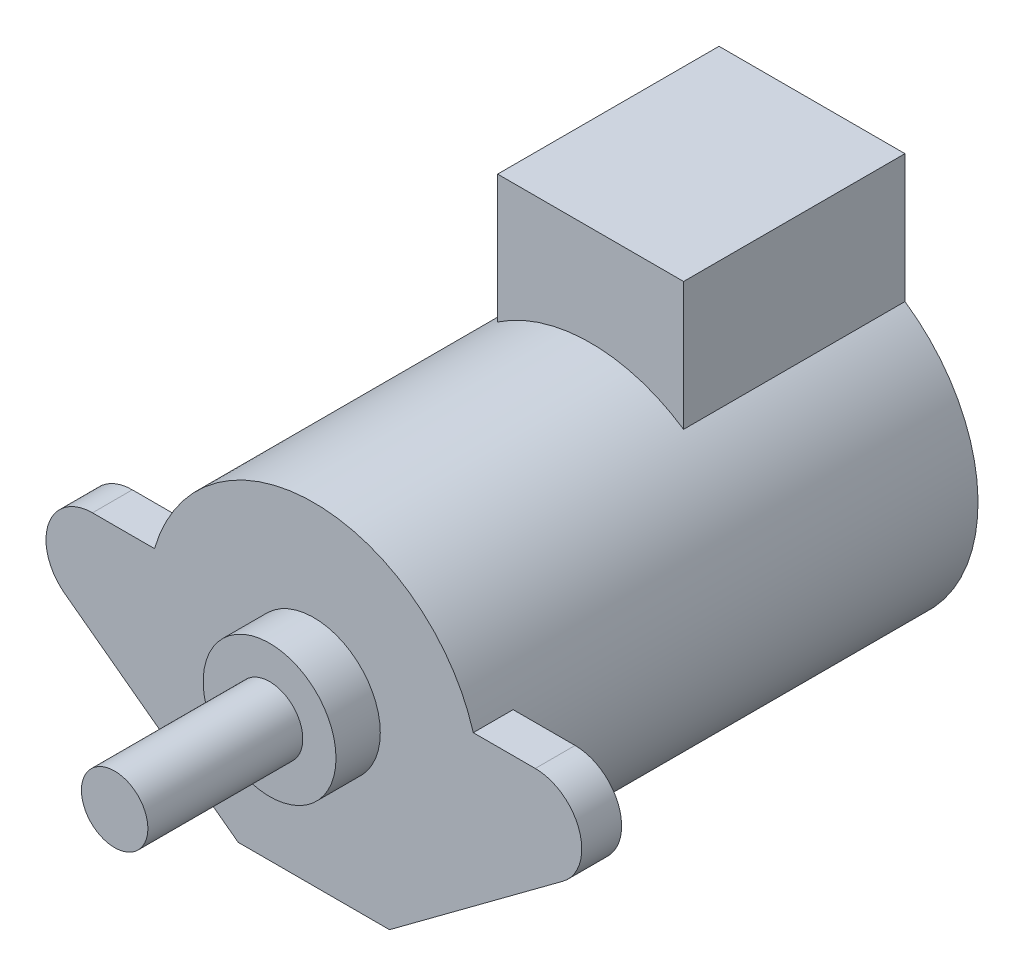
ISO-10303-21;
HEADER;
FILE_DESCRIPTION(('STEP AP214'),'2;1');
FILE_NAME('part.step','',(''),(''),'','','');
FILE_SCHEMA(('AUTOMOTIVE_DESIGN { 1 0 10303 214 1 1 1 1 }'));
ENDSEC;
DATA;
#1=APPLICATION_CONTEXT('core data for automotive mechanical design processes');
#2=APPLICATION_PROTOCOL_DEFINITION('international standard','automotive_design',2000,#1);
#3=PRODUCT_CONTEXT('',#1,'mechanical');
#4=PRODUCT('Part','Part','',(#3));
#5=PRODUCT_RELATED_PRODUCT_CATEGORY('part','',(#4));
#6=PRODUCT_DEFINITION_FORMATION('','',#4);
#7=PRODUCT_DEFINITION_CONTEXT('part definition',#1,'design');
#8=PRODUCT_DEFINITION('design','',#6,#7);
#9=PRODUCT_DEFINITION_SHAPE('','',#8);
#10=(LENGTH_UNIT() NAMED_UNIT(*) SI_UNIT(.MILLI.,.METRE.));
#11=(NAMED_UNIT(*) PLANE_ANGLE_UNIT() SI_UNIT($,.RADIAN.));
#12=(NAMED_UNIT(*) SI_UNIT($,.STERADIAN.) SOLID_ANGLE_UNIT());
#13=UNCERTAINTY_MEASURE_WITH_UNIT(LENGTH_MEASURE(1.E-05),#10,'distance_accuracy_value','');
#14=(GEOMETRIC_REPRESENTATION_CONTEXT(3) GLOBAL_UNCERTAINTY_ASSIGNED_CONTEXT((#13)) GLOBAL_UNIT_ASSIGNED_CONTEXT((#10,
#11,#12)) REPRESENTATION_CONTEXT('',''));
#15=CARTESIAN_POINT('',(0.,0.,0.));
#16=DIRECTION('',(0.,0.,1.));
#17=DIRECTION('',(1.,0.,0.));
#18=AXIS2_PLACEMENT_3D('',#15,#16,#17);
#19=CARTESIAN_POINT('',(-10.,0.,0.));
#20=DIRECTION('',(0.,0.,1.));
#21=DIRECTION('',(1.,0.,0.));
#22=AXIS2_PLACEMENT_3D('',#19,#20,#21);
#23=PLANE('',#22);
#24=CARTESIAN_POINT('',(0.,0.,0.));
#25=DIRECTION('',(0.,0.,1.));
#26=DIRECTION('',(1.,0.,0.));
#27=AXIS2_PLACEMENT_3D('',#24,#25,#26);
#28=CIRCLE('',#27,7.5);
#29=CARTESIAN_POINT('',(-4.2,6.21369455316239,0.));
#30=VERTEX_POINT('',#29);
#31=CARTESIAN_POINT('',(4.2,6.21369455316239,0.));
#32=VERTEX_POINT('',#31);
#33=EDGE_CURVE('E192',#30,#32,#28,.T.);
#34=ORIENTED_EDGE('',*,*,#33,.F.);
#35=DIRECTION('',(0.,1.,0.));
#36=VECTOR('',#35,1.);
#37=CARTESIAN_POINT('',(-4.2,12.,0.));
#38=LINE('',#37,#36);
#39=CARTESIAN_POINT('',(-4.2,12.,0.));
#40=VERTEX_POINT('',#39);
#41=EDGE_CURVE('E154',#30,#40,#38,.T.);
#42=ORIENTED_EDGE('',*,*,#41,.T.);
#43=DIRECTION('',(1.,0.,0.));
#44=VECTOR('',#43,1.);
#45=CARTESIAN_POINT('',(4.2,12.,0.));
#46=LINE('',#45,#44);
#47=CARTESIAN_POINT('',(4.2,12.,0.));
#48=VERTEX_POINT('',#47);
#49=EDGE_CURVE('E131',#40,#48,#46,.T.);
#50=ORIENTED_EDGE('',*,*,#49,.T.);
#51=DIRECTION('',(0.,-1.,0.));
#52=VECTOR('',#51,1.);
#53=CARTESIAN_POINT('',(4.2,12.,0.));
#54=LINE('',#53,#52);
#55=EDGE_CURVE('E151',#48,#32,#54,.T.);
#56=ORIENTED_EDGE('',*,*,#55,.T.);
#57=EDGE_LOOP('',(#34,#42,#50,#56));
#58=FACE_BOUND('',#57,.T.);
#59=ADVANCED_FACE('F36',(#58),#23,.F.);
#60=CARTESIAN_POINT('',(-10.,0.,22.5));
#61=DIRECTION('',(0.,0.,-1.));
#62=DIRECTION('',(-1.,0.,0.));
#63=AXIS2_PLACEMENT_3D('',#60,#61,#62);
#64=CYLINDRICAL_SURFACE('',#63,2.1);
#65=DIRECTION('',(0.,0.,-1.));
#66=VECTOR('',#65,1.);
#67=CARTESIAN_POINT('',(-10.,2.1,22.5));
#68=LINE('',#67,#66);
#69=CARTESIAN_POINT('',(-10.,2.1,22.5));
#70=VERTEX_POINT('',#69);
#71=CARTESIAN_POINT('',(-10.,2.1,20.7));
#72=VERTEX_POINT('',#71);
#73=EDGE_CURVE('E212',#70,#72,#68,.T.);
#74=ORIENTED_EDGE('',*,*,#73,.T.);
#75=CARTESIAN_POINT('',(-10.,0.,20.7));
#76=DIRECTION('',(0.,0.,1.));
#77=DIRECTION('',(1.,0.,0.));
#78=AXIS2_PLACEMENT_3D('',#75,#76,#77);
#79=CIRCLE('',#78,2.1);
#80=CARTESIAN_POINT('',(-11.2514116969437,-1.68640705784588,20.7));
#81=VERTEX_POINT('',#80);
#82=EDGE_CURVE('E169',#72,#81,#79,.T.);
#83=ORIENTED_EDGE('',*,*,#82,.T.);
#84=DIRECTION('',(0.,0.,-1.));
#85=VECTOR('',#84,1.);
#86=CARTESIAN_POINT('',(-11.2514116969437,-1.68640705784588,22.5));
#87=LINE('',#86,#85);
#88=CARTESIAN_POINT('',(-11.2514116969437,-1.68640705784588,22.5));
#89=VERTEX_POINT('',#88);
#90=EDGE_CURVE('E234',#89,#81,#87,.T.);
#91=ORIENTED_EDGE('',*,*,#90,.F.);
#92=CARTESIAN_POINT('',(-10.,0.,22.5));
#93=DIRECTION('',(0.,0.,1.));
#94=DIRECTION('',(1.,0.,0.));
#95=AXIS2_PLACEMENT_3D('',#92,#93,#94);
#96=CIRCLE('',#95,2.1);
#97=EDGE_CURVE('E195',#70,#89,#96,.T.);
#98=ORIENTED_EDGE('',*,*,#97,.F.);
#99=EDGE_LOOP('',(#74,#83,#91,#98));
#100=FACE_BOUND('',#99,.T.);
#101=ADVANCED_FACE('F38',(#100),#64,.T.);
#102=CARTESIAN_POINT('',(-11.2514116969437,-1.68640705784588,22.5));
#103=DIRECTION('',(0.595910331877969,0.80305097992661,0.));
#104=DIRECTION('',(-0.80305097992661,0.595910331877969,0.));
#105=AXIS2_PLACEMENT_3D('',#102,#103,#104);
#106=PLANE('',#105);
#107=ORIENTED_EDGE('',*,*,#90,.T.);
#108=DIRECTION('',(0.80305097992661,-0.595910331877969,0.));
#109=VECTOR('',#108,1.);
#110=CARTESIAN_POINT('',(-11.2514116969437,-1.68640705784588,20.7));
#111=LINE('',#110,#109);
#112=CARTESIAN_POINT('',(-3.4169922224928,-7.5,20.7));
#113=VERTEX_POINT('',#112);
#114=EDGE_CURVE('E172',#81,#113,#111,.T.);
#115=ORIENTED_EDGE('',*,*,#114,.T.);
#116=DIRECTION('',(0.,0.,-1.));
#117=VECTOR('',#116,1.);
#118=CARTESIAN_POINT('',(-3.4169922224928,-7.5,22.5));
#119=LINE('',#118,#117);
#120=CARTESIAN_POINT('',(-3.4169922224928,-7.5,22.5));
#121=VERTEX_POINT('',#120);
#122=EDGE_CURVE('E231',#121,#113,#119,.T.);
#123=ORIENTED_EDGE('',*,*,#122,.F.);
#124=DIRECTION('',(0.80305097992661,-0.595910331877969,0.));
#125=VECTOR('',#124,1.);
#126=CARTESIAN_POINT('',(-11.2514116969437,-1.68640705784588,22.5));
#127=LINE('',#126,#125);
#128=EDGE_CURVE('E198',#89,#121,#127,.T.);
#129=ORIENTED_EDGE('',*,*,#128,.F.);
#130=EDGE_LOOP('',(#107,#115,#123,#129));
#131=FACE_BOUND('',#130,.T.);
#132=ADVANCED_FACE('F263',(#131),#106,.F.);
#133=CARTESIAN_POINT('',(-3.4169922224928,-7.5,22.5));
#134=DIRECTION('',(0.,1.,0.));
#135=DIRECTION('',(-1.,0.,0.));
#136=AXIS2_PLACEMENT_3D('',#133,#134,#135);
#137=PLANE('',#136);
#138=ORIENTED_EDGE('',*,*,#122,.T.);
#139=DIRECTION('',(1.,0.,0.));
#140=VECTOR('',#139,1.);
#141=CARTESIAN_POINT('',(-3.4169922224928,-7.5,20.7));
#142=LINE('',#141,#140);
#143=CARTESIAN_POINT('',(0.,-7.5,20.7));
#144=VERTEX_POINT('',#143);
#145=EDGE_CURVE('E175',#113,#144,#142,.T.);
#146=ORIENTED_EDGE('',*,*,#145,.T.);
#147=CARTESIAN_POINT('',(3.4169922224928,-7.5,20.7));
#148=VERTEX_POINT('',#147);
#149=EDGE_CURVE('E178',#144,#148,#142,.T.);
#150=ORIENTED_EDGE('',*,*,#149,.T.);
#151=DIRECTION('',(0.,0.,-1.));
#152=VECTOR('',#151,1.);
#153=CARTESIAN_POINT('',(3.4169922224928,-7.5,22.5));
#154=LINE('',#153,#152);
#155=CARTESIAN_POINT('',(3.4169922224928,-7.5,22.5));
#156=VERTEX_POINT('',#155);
#157=EDGE_CURVE('E228',#156,#148,#154,.T.);
#158=ORIENTED_EDGE('',*,*,#157,.F.);
#159=DIRECTION('',(1.,0.,0.));
#160=VECTOR('',#159,1.);
#161=CARTESIAN_POINT('',(-3.4169922224928,-7.5,22.5));
#162=LINE('',#161,#160);
#163=EDGE_CURVE('E200',#121,#156,#162,.T.);
#164=ORIENTED_EDGE('',*,*,#163,.F.);
#165=EDGE_LOOP('',(#138,#146,#150,#158,#164));
#166=FACE_BOUND('',#165,.T.);
#167=ADVANCED_FACE('F259',(#166),#137,.F.);
#168=CARTESIAN_POINT('',(3.4169922224928,-7.5,22.5));
#169=DIRECTION('',(-0.595910331877969,0.80305097992661,0.));
#170=DIRECTION('',(-0.80305097992661,-0.595910331877969,0.));
#171=AXIS2_PLACEMENT_3D('',#168,#169,#170);
#172=PLANE('',#171);
#173=ORIENTED_EDGE('',*,*,#157,.T.);
#174=DIRECTION('',(0.80305097992661,0.595910331877969,0.));
#175=VECTOR('',#174,1.);
#176=CARTESIAN_POINT('',(3.4169922224928,-7.5,20.7));
#177=LINE('',#176,#175);
#178=CARTESIAN_POINT('',(11.2514116969437,-1.68640705784588,20.7));
#179=VERTEX_POINT('',#178);
#180=EDGE_CURVE('E179',#148,#179,#177,.T.);
#181=ORIENTED_EDGE('',*,*,#180,.T.);
#182=DIRECTION('',(0.,0.,-1.));
#183=VECTOR('',#182,1.);
#184=CARTESIAN_POINT('',(11.2514116969437,-1.68640705784588,22.5));
#185=LINE('',#184,#183);
#186=CARTESIAN_POINT('',(11.2514116969437,-1.68640705784588,22.5));
#187=VERTEX_POINT('',#186);
#188=EDGE_CURVE('E225',#187,#179,#185,.T.);
#189=ORIENTED_EDGE('',*,*,#188,.F.);
#190=DIRECTION('',(0.80305097992661,0.595910331877969,0.));
#191=VECTOR('',#190,1.);
#192=CARTESIAN_POINT('',(3.4169922224928,-7.5,22.5));
#193=LINE('',#192,#191);
#194=EDGE_CURVE('E202',#156,#187,#193,.T.);
#195=ORIENTED_EDGE('',*,*,#194,.F.);
#196=EDGE_LOOP('',(#173,#181,#189,#195));
#197=FACE_BOUND('',#196,.T.);
#198=ADVANCED_FACE('F269',(#197),#172,.F.);
#199=CARTESIAN_POINT('',(10.,0.,22.5));
#200=DIRECTION('',(0.,0.,-1.));
#201=DIRECTION('',(-1.,0.,0.));
#202=AXIS2_PLACEMENT_3D('',#199,#200,#201);
#203=CYLINDRICAL_SURFACE('',#202,2.1);
#204=ORIENTED_EDGE('',*,*,#188,.T.);
#205=CARTESIAN_POINT('',(10.,0.,20.7));
#206=DIRECTION('',(0.,0.,1.));
#207=DIRECTION('',(1.,0.,0.));
#208=AXIS2_PLACEMENT_3D('',#205,#206,#207);
#209=CIRCLE('',#208,2.1);
#210=CARTESIAN_POINT('',(10.,2.10000000000001,20.7));
#211=VERTEX_POINT('',#210);
#212=EDGE_CURVE('E182',#179,#211,#209,.T.);
#213=ORIENTED_EDGE('',*,*,#212,.T.);
#214=DIRECTION('',(0.,0.,-1.));
#215=VECTOR('',#214,1.);
#216=CARTESIAN_POINT('',(10.,2.10000000000001,22.5));
#217=LINE('',#216,#215);
#218=CARTESIAN_POINT('',(10.,2.10000000000001,22.5));
#219=VERTEX_POINT('',#218);
#220=EDGE_CURVE('E222',#219,#211,#217,.T.);
#221=ORIENTED_EDGE('',*,*,#220,.F.);
#222=CARTESIAN_POINT('',(10.,0.,22.5));
#223=DIRECTION('',(0.,0.,1.));
#224=DIRECTION('',(1.,0.,0.));
#225=AXIS2_PLACEMENT_3D('',#222,#223,#224);
#226=CIRCLE('',#225,2.1);
#227=EDGE_CURVE('E204',#187,#219,#226,.T.);
#228=ORIENTED_EDGE('',*,*,#227,.F.);
#229=EDGE_LOOP('',(#204,#213,#221,#228));
#230=FACE_BOUND('',#229,.T.);
#231=ADVANCED_FACE('F286',(#230),#203,.T.);
#232=CARTESIAN_POINT('',(10.,2.1,22.5));
#233=DIRECTION('',(0.,-1.,0.));
#234=DIRECTION('',(1.,0.,0.));
#235=AXIS2_PLACEMENT_3D('',#232,#233,#234);
#236=PLANE('',#235);
#237=ORIENTED_EDGE('',*,*,#220,.T.);
#238=DIRECTION('',(-1.,0.,0.));
#239=VECTOR('',#238,1.);
#240=CARTESIAN_POINT('',(10.,2.1,20.7));
#241=LINE('',#240,#239);
#242=CARTESIAN_POINT('',(7.2,2.1,20.7));
#243=VERTEX_POINT('',#242);
#244=EDGE_CURVE('E185',#211,#243,#241,.T.);
#245=ORIENTED_EDGE('',*,*,#244,.T.);
#246=DIRECTION('',(0.,0.,-1.));
#247=VECTOR('',#246,1.);
#248=CARTESIAN_POINT('',(7.2,2.1,22.5));
#249=LINE('',#248,#247);
#250=CARTESIAN_POINT('',(7.2,2.1,22.5));
#251=VERTEX_POINT('',#250);
#252=EDGE_CURVE('E219',#251,#243,#249,.T.);
#253=ORIENTED_EDGE('',*,*,#252,.F.);
#254=DIRECTION('',(-1.,0.,0.));
#255=VECTOR('',#254,1.);
#256=CARTESIAN_POINT('',(10.,2.1,22.5));
#257=LINE('',#256,#255);
#258=EDGE_CURVE('E206',#219,#251,#257,.T.);
#259=ORIENTED_EDGE('',*,*,#258,.F.);
#260=EDGE_LOOP('',(#237,#245,#253,#259));
#261=FACE_BOUND('',#260,.T.);
#262=ADVANCED_FACE('F283',(#261),#236,.F.);
#263=CARTESIAN_POINT('',(0.,0.,22.5));
#264=DIRECTION('',(0.,0.,-1.));
#265=DIRECTION('',(-1.,0.,0.));
#266=AXIS2_PLACEMENT_3D('',#263,#264,#265);
#267=CYLINDRICAL_SURFACE('',#266,7.5);
#268=CARTESIAN_POINT('',(0.,0.,10.));
#269=DIRECTION('',(0.,0.,-1.));
#270=DIRECTION('',(-1.,0.,0.));
#271=AXIS2_PLACEMENT_3D('',#268,#269,#270);
#272=CIRCLE('',#271,7.5);
#273=CARTESIAN_POINT('',(-4.2,6.21369455316239,10.));
#274=VERTEX_POINT('',#273);
#275=CARTESIAN_POINT('',(4.2,6.21369455316239,10.));
#276=VERTEX_POINT('',#275);
#277=EDGE_CURVE('E13',#274,#276,#272,.T.);
#278=ORIENTED_EDGE('',*,*,#277,.F.);
#279=DIRECTION('',(0.,0.,-1.));
#280=VECTOR('',#279,1.);
#281=CARTESIAN_POINT('',(-4.2,6.21369455316239,10.));
#282=LINE('',#281,#280);
#283=EDGE_CURVE('E136',#274,#30,#282,.T.);
#284=ORIENTED_EDGE('',*,*,#283,.T.);
#285=ORIENTED_EDGE('',*,*,#33,.T.);
#286=DIRECTION('',(0.,0.,-1.));
#287=VECTOR('',#286,1.);
#288=CARTESIAN_POINT('',(4.2,6.21369455316239,10.));
#289=LINE('',#288,#287);
#290=EDGE_CURVE('E51',#276,#32,#289,.T.);
#291=ORIENTED_EDGE('',*,*,#290,.F.);
#292=EDGE_LOOP('',(#278,#284,#285,#291));
#293=FACE_BOUND('',#292,.T.);
#294=ORIENTED_EDGE('',*,*,#252,.T.);
#295=CARTESIAN_POINT('',(0.,0.,20.7));
#296=DIRECTION('',(0.,0.,1.));
#297=DIRECTION('',(1.,0.,0.));
#298=AXIS2_PLACEMENT_3D('',#295,#296,#297);
#299=CIRCLE('',#298,7.5);
#300=EDGE_CURVE('E165',#243,#144,#299,.F.);
#301=ORIENTED_EDGE('',*,*,#300,.T.);
#302=CARTESIAN_POINT('',(-7.2,2.1,20.7));
#303=VERTEX_POINT('',#302);
#304=EDGE_CURVE('E166',#144,#303,#299,.F.);
#305=ORIENTED_EDGE('',*,*,#304,.T.);
#306=DIRECTION('',(0.,0.,-1.));
#307=VECTOR('',#306,1.);
#308=CARTESIAN_POINT('',(-7.2,2.1,22.5));
#309=LINE('',#308,#307);
#310=CARTESIAN_POINT('',(-7.2,2.1,22.5));
#311=VERTEX_POINT('',#310);
#312=EDGE_CURVE('E216',#311,#303,#309,.T.);
#313=ORIENTED_EDGE('',*,*,#312,.F.);
#314=CARTESIAN_POINT('',(0.,0.,22.5));
#315=DIRECTION('',(0.,0.,1.));
#316=DIRECTION('',(1.,0.,0.));
#317=AXIS2_PLACEMENT_3D('',#314,#315,#316);
#318=CIRCLE('',#317,7.5);
#319=EDGE_CURVE('E208',#251,#311,#318,.T.);
#320=ORIENTED_EDGE('',*,*,#319,.F.);
#321=EDGE_LOOP('',(#294,#301,#305,#313,#320));
#322=FACE_BOUND('',#321,.T.);
#323=ADVANCED_FACE('F254',(#293,#322),#267,.T.);
#324=CARTESIAN_POINT('',(-10.,2.1,22.5));
#325=DIRECTION('',(0.,-1.,0.));
#326=DIRECTION('',(1.,0.,0.));
#327=AXIS2_PLACEMENT_3D('',#324,#325,#326);
#328=PLANE('',#327);
#329=ORIENTED_EDGE('',*,*,#312,.T.);
#330=DIRECTION('',(-1.,0.,0.));
#331=VECTOR('',#330,1.);
#332=CARTESIAN_POINT('',(-10.,2.1,20.7));
#333=LINE('',#332,#331);
#334=EDGE_CURVE('E44',#303,#72,#333,.T.);
#335=ORIENTED_EDGE('',*,*,#334,.T.);
#336=ORIENTED_EDGE('',*,*,#73,.F.);
#337=DIRECTION('',(-1.,0.,0.));
#338=VECTOR('',#337,1.);
#339=CARTESIAN_POINT('',(-10.,2.1,22.5));
#340=LINE('',#339,#338);
#341=EDGE_CURVE('E210',#311,#70,#340,.T.);
#342=ORIENTED_EDGE('',*,*,#341,.F.);
#343=EDGE_LOOP('',(#329,#335,#336,#342));
#344=FACE_BOUND('',#343,.T.);
#345=ADVANCED_FACE('F239',(#344),#328,.F.);
#346=CARTESIAN_POINT('',(-10.,0.,22.5));
#347=DIRECTION('',(0.,0.,1.));
#348=DIRECTION('',(1.,0.,0.));
#349=AXIS2_PLACEMENT_3D('',#346,#347,#348);
#350=PLANE('',#349);
#351=CARTESIAN_POINT('',(0.,0.,22.5));
#352=DIRECTION('',(0.,0.,1.));
#353=DIRECTION('',(1.,0.,0.));
#354=AXIS2_PLACEMENT_3D('',#351,#352,#353);
#355=CIRCLE('',#354,3.);
#356=CARTESIAN_POINT('',(3.,0.,22.5));
#357=VERTEX_POINT('',#356);
#358=EDGE_CURVE('E188',#357,#357,#355,.T.);
#359=ORIENTED_EDGE('',*,*,#358,.F.);
#360=EDGE_LOOP('',(#359));
#361=FACE_BOUND('',#360,.T.);
#362=ORIENTED_EDGE('',*,*,#97,.T.);
#363=ORIENTED_EDGE('',*,*,#128,.T.);
#364=ORIENTED_EDGE('',*,*,#163,.T.);
#365=ORIENTED_EDGE('',*,*,#194,.T.);
#366=ORIENTED_EDGE('',*,*,#227,.T.);
#367=ORIENTED_EDGE('',*,*,#258,.T.);
#368=ORIENTED_EDGE('',*,*,#319,.T.);
#369=ORIENTED_EDGE('',*,*,#341,.T.);
#370=EDGE_LOOP('',(#362,#363,#364,#365,#366,#367,#368,#369));
#371=FACE_BOUND('',#370,.T.);
#372=ADVANCED_FACE('F248',(#361,#371),#350,.T.);
#373=CARTESIAN_POINT('',(0.,0.,24.5));
#374=DIRECTION('',(0.,0.,-1.));
#375=DIRECTION('',(-1.,0.,0.));
#376=AXIS2_PLACEMENT_3D('',#373,#374,#375);
#377=CYLINDRICAL_SURFACE('',#376,3.);
#378=CARTESIAN_POINT('',(0.,0.,24.5));
#379=DIRECTION('',(0.,0.,1.));
#380=DIRECTION('',(1.,0.,0.));
#381=AXIS2_PLACEMENT_3D('',#378,#379,#380);
#382=CIRCLE('',#381,3.);
#383=CARTESIAN_POINT('',(3.,0.,24.5));
#384=VERTEX_POINT('',#383);
#385=EDGE_CURVE('E189',#384,#384,#382,.T.);
#386=ORIENTED_EDGE('',*,*,#385,.F.);
#387=EDGE_LOOP('',(#386));
#388=FACE_BOUND('',#387,.T.);
#389=ORIENTED_EDGE('',*,*,#358,.T.);
#390=EDGE_LOOP('',(#389));
#391=FACE_BOUND('',#390,.T.);
#392=ADVANCED_FACE('F309',(#388,#391),#377,.T.);
#393=CARTESIAN_POINT('',(0.,0.,24.5));
#394=DIRECTION('',(0.,0.,1.));
#395=DIRECTION('',(1.,0.,0.));
#396=AXIS2_PLACEMENT_3D('',#393,#394,#395);
#397=PLANE('',#396);
#398=CARTESIAN_POINT('',(0.,0.,24.5));
#399=DIRECTION('',(0.,0.,1.));
#400=DIRECTION('',(1.,0.,0.));
#401=AXIS2_PLACEMENT_3D('',#398,#399,#400);
#402=CIRCLE('',#401,1.5);
#403=CARTESIAN_POINT('',(-1.5,0.,24.5));
#404=VERTEX_POINT('',#403);
#405=EDGE_CURVE('E157',#404,#404,#402,.T.);
#406=ORIENTED_EDGE('',*,*,#405,.F.);
#407=EDGE_LOOP('',(#406));
#408=FACE_BOUND('',#407,.T.);
#409=ORIENTED_EDGE('',*,*,#385,.T.);
#410=EDGE_LOOP('',(#409));
#411=FACE_BOUND('',#410,.T.);
#412=ADVANCED_FACE('F302',(#408,#411),#397,.T.);
#413=CARTESIAN_POINT('',(-10.,0.,20.7));
#414=DIRECTION('',(0.,0.,1.));
#415=DIRECTION('',(1.,0.,0.));
#416=AXIS2_PLACEMENT_3D('',#413,#414,#415);
#417=PLANE('',#416);
#418=ORIENTED_EDGE('',*,*,#212,.F.);
#419=ORIENTED_EDGE('',*,*,#180,.F.);
#420=ORIENTED_EDGE('',*,*,#149,.F.);
#421=ORIENTED_EDGE('',*,*,#300,.F.);
#422=ORIENTED_EDGE('',*,*,#244,.F.);
#423=EDGE_LOOP('',(#418,#419,#420,#421,#422));
#424=FACE_BOUND('',#423,.T.);
#425=ADVANCED_FACE('F300',(#424),#417,.F.);
#426=ORIENTED_EDGE('',*,*,#114,.F.);
#427=ORIENTED_EDGE('',*,*,#82,.F.);
#428=ORIENTED_EDGE('',*,*,#334,.F.);
#429=ORIENTED_EDGE('',*,*,#304,.F.);
#430=ORIENTED_EDGE('',*,*,#145,.F.);
#431=EDGE_LOOP('',(#426,#427,#428,#429,#430));
#432=FACE_BOUND('',#431,.T.);
#433=ADVANCED_FACE('F256',(#432),#417,.F.);
#434=CARTESIAN_POINT('',(0.,0.,44.7426406871193));
#435=DIRECTION('',(0.,0.,-1.));
#436=DIRECTION('',(-1.,0.,0.));
#437=AXIS2_PLACEMENT_3D('',#434,#435,#436);
#438=CYLINDRICAL_SURFACE('',#437,1.5);
#439=CARTESIAN_POINT('',(0.,0.,31.5));
#440=DIRECTION('',(0.,0.,1.));
#441=DIRECTION('',(1.,0.,0.));
#442=AXIS2_PLACEMENT_3D('',#439,#440,#441);
#443=CIRCLE('',#442,1.5);
#444=CARTESIAN_POINT('',(-1.5,0.,31.5));
#445=VERTEX_POINT('',#444);
#446=EDGE_CURVE('E162',#445,#445,#443,.T.);
#447=CARTESIAN_POINT('',(-1.5,0.,24.5));
#448=CARTESIAN_POINT('',(-1.5,0.,24.5729166666667));
#449=CARTESIAN_POINT('',(-1.5,0.,24.6458333333333));
#450=CARTESIAN_POINT('',(-1.5,0.,24.7916666666667));
#451=CARTESIAN_POINT('',(-1.5,0.,24.8645833333333));
#452=CARTESIAN_POINT('',(-1.5,0.,25.0104166666667));
#453=CARTESIAN_POINT('',(-1.5,0.,25.0833333333333));
#454=CARTESIAN_POINT('',(-1.5,0.,25.2291666666667));
#455=CARTESIAN_POINT('',(-1.5,0.,25.3020833333333));
#456=CARTESIAN_POINT('',(-1.5,0.,25.4479166666667));
#457=CARTESIAN_POINT('',(-1.5,0.,25.5208333333333));
#458=CARTESIAN_POINT('',(-1.5,0.,25.6666666666667));
#459=CARTESIAN_POINT('',(-1.5,0.,25.7395833333333));
#460=CARTESIAN_POINT('',(-1.5,0.,25.8854166666667));
#461=CARTESIAN_POINT('',(-1.5,0.,25.9583333333333));
#462=CARTESIAN_POINT('',(-1.5,0.,26.1041666666667));
#463=CARTESIAN_POINT('',(-1.5,0.,26.1770833333333));
#464=CARTESIAN_POINT('',(-1.5,0.,26.3229166666667));
#465=CARTESIAN_POINT('',(-1.5,0.,26.3958333333333));
#466=CARTESIAN_POINT('',(-1.5,0.,26.5416666666667));
#467=CARTESIAN_POINT('',(-1.5,0.,26.6145833333333));
#468=CARTESIAN_POINT('',(-1.5,0.,26.7604166666667));
#469=CARTESIAN_POINT('',(-1.5,0.,26.8333333333333));
#470=CARTESIAN_POINT('',(-1.5,0.,26.9791666666667));
#471=CARTESIAN_POINT('',(-1.5,0.,27.0520833333333));
#472=CARTESIAN_POINT('',(-1.5,0.,27.1979166666667));
#473=CARTESIAN_POINT('',(-1.5,0.,27.2708333333333));
#474=CARTESIAN_POINT('',(-1.5,0.,27.4166666666667));
#475=CARTESIAN_POINT('',(-1.5,0.,27.4895833333333));
#476=CARTESIAN_POINT('',(-1.5,0.,27.6354166666667));
#477=CARTESIAN_POINT('',(-1.5,0.,27.7083333333333));
#478=CARTESIAN_POINT('',(-1.5,0.,27.8541666666667));
#479=CARTESIAN_POINT('',(-1.5,0.,27.9270833333333));
#480=CARTESIAN_POINT('',(-1.5,0.,28.0729166666667));
#481=CARTESIAN_POINT('',(-1.5,0.,28.1458333333333));
#482=CARTESIAN_POINT('',(-1.5,0.,28.2916666666667));
#483=CARTESIAN_POINT('',(-1.5,0.,28.3645833333333));
#484=CARTESIAN_POINT('',(-1.5,0.,28.5104166666667));
#485=CARTESIAN_POINT('',(-1.5,0.,28.5833333333333));
#486=CARTESIAN_POINT('',(-1.5,0.,28.7291666666667));
#487=CARTESIAN_POINT('',(-1.5,0.,28.8020833333333));
#488=CARTESIAN_POINT('',(-1.5,0.,28.9479166666667));
#489=CARTESIAN_POINT('',(-1.5,0.,29.0208333333333));
#490=CARTESIAN_POINT('',(-1.5,0.,29.1666666666667));
#491=CARTESIAN_POINT('',(-1.5,0.,29.2395833333333));
#492=CARTESIAN_POINT('',(-1.5,0.,29.3854166666667));
#493=CARTESIAN_POINT('',(-1.5,0.,29.4583333333333));
#494=CARTESIAN_POINT('',(-1.5,0.,29.6041666666667));
#495=CARTESIAN_POINT('',(-1.5,0.,29.6770833333333));
#496=CARTESIAN_POINT('',(-1.5,0.,29.8229166666667));
#497=CARTESIAN_POINT('',(-1.5,0.,29.8958333333333));
#498=CARTESIAN_POINT('',(-1.5,0.,30.0416666666667));
#499=CARTESIAN_POINT('',(-1.5,0.,30.1145833333333));
#500=CARTESIAN_POINT('',(-1.5,0.,30.2604166666667));
#501=CARTESIAN_POINT('',(-1.5,0.,30.3333333333333));
#502=CARTESIAN_POINT('',(-1.5,0.,30.4791666666667));
#503=CARTESIAN_POINT('',(-1.5,0.,30.5520833333333));
#504=CARTESIAN_POINT('',(-1.5,0.,30.6979166666667));
#505=CARTESIAN_POINT('',(-1.5,0.,30.7708333333333));
#506=CARTESIAN_POINT('',(-1.5,0.,30.9166666666667));
#507=CARTESIAN_POINT('',(-1.5,0.,30.9895833333333));
#508=CARTESIAN_POINT('',(-1.5,0.,31.1354166666667));
#509=CARTESIAN_POINT('',(-1.5,0.,31.2083333333333));
#510=CARTESIAN_POINT('',(-1.5,0.,31.3541666666667));
#511=CARTESIAN_POINT('',(-1.5,0.,31.4270833333333));
#512=CARTESIAN_POINT('',(-1.5,0.,31.5));
#513=B_SPLINE_CURVE_WITH_KNOTS('',3,(#447,#448,#449,#450,#451,#452,#453,#454,#455,#456,#457,
#458,#459,#460,#461,#462,#463,#464,#465,#466,#467,#468,#469,#470,#471,#472,#473,#474,#475,#476,
#477,#478,#479,#480,#481,#482,#483,#484,#485,#486,#487,#488,#489,#490,#491,#492,#493,#494,#495,
#496,#497,#498,#499,#500,#501,#502,#503,#504,#505,#506,#507,#508,#509,#510,#511,#512),
.UNSPECIFIED.,.F.,.F.,(4,2,2,2,2,2,2,2,2,2,2,2,2,2,2,2,2,2,2,2,2,2,2,2,2,2,2,2,2,2,2,2,4),(0.,
0.21875,0.4375,0.656250000000001,0.875000000000001,1.09375,1.3125,1.53125,1.75,1.96875,2.1875,
2.40625,2.625,2.84375,3.0625,3.28125,3.5,3.71875,3.9375,4.15625,4.375,4.59375,4.8125,5.03125,
5.25,5.46875,5.6875,5.90625,6.12499999999999,6.34375,6.5625,6.78125,7.),.UNSPECIFIED.);
#514=EDGE_CURVE('BSEAM308',#404,#445,#513,.T.);
#515=ORIENTED_EDGE('',*,*,#405,.T.);
#516=ORIENTED_EDGE('',*,*,#446,.F.);
#517=ORIENTED_EDGE('',*,*,#514,.T.);
#518=ORIENTED_EDGE('',*,*,#514,.F.);
#519=EDGE_LOOP('',(#515,#517,#516,#518));
#520=FACE_BOUND('',#519,.T.);
#521=ADVANCED_FACE('F308',(#520),#438,.T.);
#522=CARTESIAN_POINT('',(-10.,0.,31.5));
#523=DIRECTION('',(0.,0.,1.));
#524=DIRECTION('',(1.,0.,0.));
#525=AXIS2_PLACEMENT_3D('',#522,#523,#524);
#526=PLANE('',#525);
#527=ORIENTED_EDGE('',*,*,#446,.T.);
#528=EDGE_LOOP('',(#527));
#529=FACE_BOUND('',#528,.T.);
#530=ADVANCED_FACE('F313',(#529),#526,.T.);
#531=CARTESIAN_POINT('',(4.2,12.,10.));
#532=DIRECTION('',(1.,0.,0.));
#533=DIRECTION('',(0.,0.,-1.));
#534=AXIS2_PLACEMENT_3D('',#531,#532,#533);
#535=PLANE('',#534);
#536=ORIENTED_EDGE('',*,*,#55,.F.);
#537=DIRECTION('',(0.,0.,-1.));
#538=VECTOR('',#537,1.);
#539=CARTESIAN_POINT('',(4.2,12.,10.));
#540=LINE('',#539,#538);
#541=CARTESIAN_POINT('',(4.2,12.,10.));
#542=VERTEX_POINT('',#541);
#543=EDGE_CURVE('E135',#542,#48,#540,.T.);
#544=ORIENTED_EDGE('',*,*,#543,.F.);
#545=DIRECTION('',(0.,-1.,0.));
#546=VECTOR('',#545,1.);
#547=CARTESIAN_POINT('',(4.2,12.,10.));
#548=LINE('',#547,#546);
#549=EDGE_CURVE('E142',#542,#276,#548,.T.);
#550=ORIENTED_EDGE('',*,*,#549,.T.);
#551=ORIENTED_EDGE('',*,*,#290,.T.);
#552=EDGE_LOOP('',(#536,#544,#550,#551));
#553=FACE_BOUND('',#552,.T.);
#554=ADVANCED_FACE('F412',(#553),#535,.T.);
#555=CARTESIAN_POINT('',(4.2,12.,10.));
#556=DIRECTION('',(0.,1.,0.));
#557=DIRECTION('',(0.,0.,1.));
#558=AXIS2_PLACEMENT_3D('',#555,#556,#557);
#559=PLANE('',#558);
#560=ORIENTED_EDGE('',*,*,#49,.F.);
#561=DIRECTION('',(0.,0.,-1.));
#562=VECTOR('',#561,1.);
#563=CARTESIAN_POINT('',(-4.2,12.,10.));
#564=LINE('',#563,#562);
#565=CARTESIAN_POINT('',(-4.2,12.,10.));
#566=VERTEX_POINT('',#565);
#567=EDGE_CURVE('E125',#566,#40,#564,.T.);
#568=ORIENTED_EDGE('',*,*,#567,.F.);
#569=DIRECTION('',(1.,0.,0.));
#570=VECTOR('',#569,1.);
#571=CARTESIAN_POINT('',(4.2,12.,10.));
#572=LINE('',#571,#570);
#573=EDGE_CURVE('E129',#566,#542,#572,.T.);
#574=ORIENTED_EDGE('',*,*,#573,.T.);
#575=ORIENTED_EDGE('',*,*,#543,.T.);
#576=EDGE_LOOP('',(#560,#568,#574,#575));
#577=FACE_BOUND('',#576,.T.);
#578=ADVANCED_FACE('F127',(#577),#559,.T.);
#579=CARTESIAN_POINT('',(-4.2,12.,10.));
#580=DIRECTION('',(-1.,0.,0.));
#581=DIRECTION('',(0.,0.,1.));
#582=AXIS2_PLACEMENT_3D('',#579,#580,#581);
#583=PLANE('',#582);
#584=ORIENTED_EDGE('',*,*,#41,.F.);
#585=ORIENTED_EDGE('',*,*,#283,.F.);
#586=DIRECTION('',(0.,1.,0.));
#587=VECTOR('',#586,1.);
#588=CARTESIAN_POINT('',(-4.2,12.,10.));
#589=LINE('',#588,#587);
#590=EDGE_CURVE('E139',#274,#566,#589,.T.);
#591=ORIENTED_EDGE('',*,*,#590,.T.);
#592=ORIENTED_EDGE('',*,*,#567,.T.);
#593=EDGE_LOOP('',(#584,#585,#591,#592));
#594=FACE_BOUND('',#593,.T.);
#595=ADVANCED_FACE('F140',(#594),#583,.T.);
#596=CARTESIAN_POINT('',(0.,0.,10.));
#597=DIRECTION('',(0.,0.,-1.));
#598=DIRECTION('',(-1.,0.,0.));
#599=AXIS2_PLACEMENT_3D('',#596,#597,#598);
#600=PLANE('',#599);
#601=ORIENTED_EDGE('',*,*,#590,.F.);
#602=ORIENTED_EDGE('',*,*,#277,.T.);
#603=ORIENTED_EDGE('',*,*,#549,.F.);
#604=ORIENTED_EDGE('',*,*,#573,.F.);
#605=EDGE_LOOP('',(#601,#602,#603,#604));
#606=FACE_BOUND('',#605,.T.);
#607=ADVANCED_FACE('F145',(#606),#600,.F.);
#608=CLOSED_SHELL('',(#59,#101,#132,#167,#198,#231,#262,#323,#345,#372,#392,#412,#425,#433,#521,
#530,#554,#578,#595,#607));
#609=MANIFOLD_SOLID_BREP('B2',#608);
#610=ADVANCED_BREP_SHAPE_REPRESENTATION('',(#18,#609),#14);
#611=SHAPE_DEFINITION_REPRESENTATION(#9,#610);
ENDSEC;
END-ISO-10303-21;
